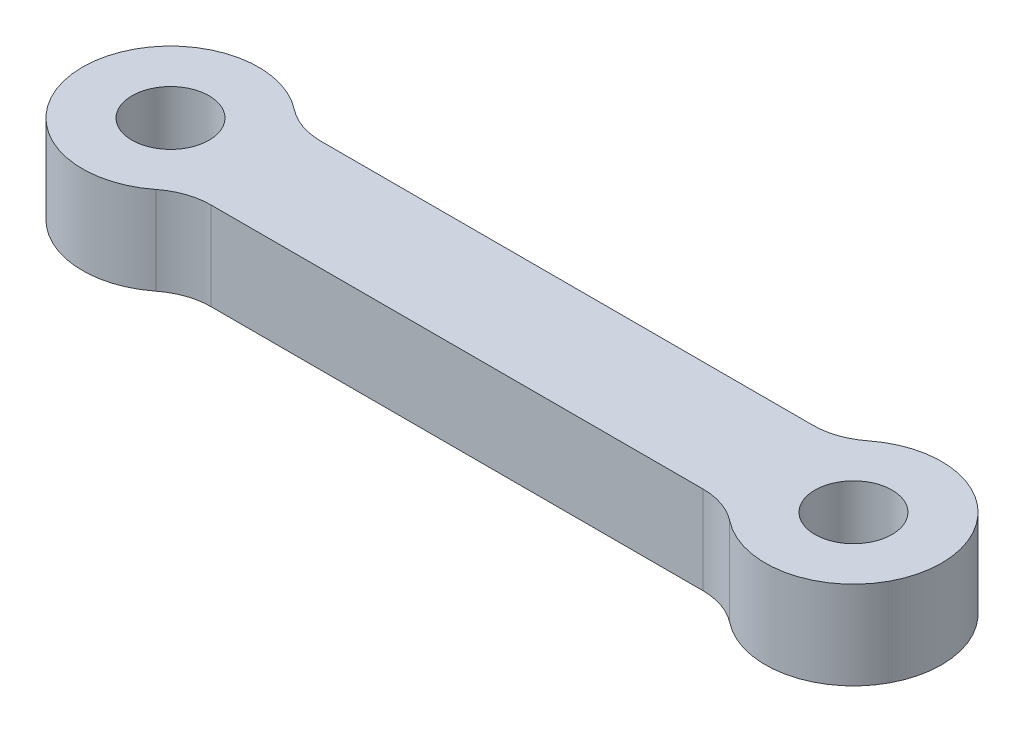
ISO-10303-21;
HEADER;
FILE_DESCRIPTION(('STEP AP214'),'2;1');
FILE_NAME('part.step','',(''),(''),'','','');
FILE_SCHEMA(('AUTOMOTIVE_DESIGN { 1 0 10303 214 1 1 1 1 }'));
ENDSEC;
DATA;
#1=APPLICATION_CONTEXT('core data for automotive mechanical design processes');
#2=APPLICATION_PROTOCOL_DEFINITION('international standard','automotive_design',2000,#1);
#3=PRODUCT_CONTEXT('',#1,'mechanical');
#4=PRODUCT('Part','Part','',(#3));
#5=PRODUCT_RELATED_PRODUCT_CATEGORY('part','',(#4));
#6=PRODUCT_DEFINITION_FORMATION('','',#4);
#7=PRODUCT_DEFINITION_CONTEXT('part definition',#1,'design');
#8=PRODUCT_DEFINITION('design','',#6,#7);
#9=PRODUCT_DEFINITION_SHAPE('','',#8);
#10=(LENGTH_UNIT() NAMED_UNIT(*) SI_UNIT(.MILLI.,.METRE.));
#11=(NAMED_UNIT(*) PLANE_ANGLE_UNIT() SI_UNIT($,.RADIAN.));
#12=(NAMED_UNIT(*) SI_UNIT($,.STERADIAN.) SOLID_ANGLE_UNIT());
#13=UNCERTAINTY_MEASURE_WITH_UNIT(LENGTH_MEASURE(1.E-05),#10,'distance_accuracy_value','');
#14=(GEOMETRIC_REPRESENTATION_CONTEXT(3) GLOBAL_UNCERTAINTY_ASSIGNED_CONTEXT((#13)) GLOBAL_UNIT_ASSIGNED_CONTEXT((#10,
#11,#12)) REPRESENTATION_CONTEXT('',''));
#15=CARTESIAN_POINT('',(0.,0.,0.));
#16=DIRECTION('',(0.,0.,1.));
#17=DIRECTION('',(1.,0.,0.));
#18=AXIS2_PLACEMENT_3D('',#15,#16,#17);
#19=CARTESIAN_POINT('',(31.,4.,0.));
#20=DIRECTION('',(0.,-1.,0.));
#21=DIRECTION('',(0.,0.,-1.));
#22=AXIS2_PLACEMENT_3D('',#19,#20,#21);
#23=CYLINDRICAL_SURFACE('',#22,4.00000000000001);
#24=CARTESIAN_POINT('',(31.,4.,0.));
#25=DIRECTION('',(0.,1.,0.));
#26=DIRECTION('',(0.,0.,1.));
#27=AXIS2_PLACEMENT_3D('',#24,#25,#26);
#28=CIRCLE('',#27,4.00000000000001);
#29=CARTESIAN_POINT('',(28.525641703473,4.,3.14285714285714));
#30=VERTEX_POINT('',#29);
#31=CARTESIAN_POINT('',(28.525641703473,4.,-3.14285714285714));
#32=VERTEX_POINT('',#31);
#33=EDGE_CURVE('E163',#30,#32,#28,.T.);
#34=ORIENTED_EDGE('',*,*,#33,.F.);
#35=DIRECTION('',(0.,-1.,0.));
#36=VECTOR('',#35,1.);
#37=CARTESIAN_POINT('',(28.525641703473,4.,3.14285714285714));
#38=LINE('',#37,#36);
#39=CARTESIAN_POINT('',(28.525641703473,0.,3.14285714285714));
#40=VERTEX_POINT('',#39);
#41=EDGE_CURVE('E175',#30,#40,#38,.T.);
#42=ORIENTED_EDGE('',*,*,#41,.T.);
#43=CARTESIAN_POINT('',(31.,0.,0.));
#44=DIRECTION('',(0.,1.,0.));
#45=DIRECTION('',(0.,0.,1.));
#46=AXIS2_PLACEMENT_3D('',#43,#44,#45);
#47=CIRCLE('',#46,4.00000000000001);
#48=CARTESIAN_POINT('',(28.525641703473,0.,-3.14285714285714));
#49=VERTEX_POINT('',#48);
#50=EDGE_CURVE('E203',#40,#49,#47,.T.);
#51=ORIENTED_EDGE('',*,*,#50,.T.);
#52=DIRECTION('',(0.,-1.,0.));
#53=VECTOR('',#52,1.);
#54=CARTESIAN_POINT('',(28.525641703473,4.,-3.14285714285714));
#55=LINE('',#54,#53);
#56=EDGE_CURVE('E172',#49,#32,#55,.F.);
#57=ORIENTED_EDGE('',*,*,#56,.T.);
#58=EDGE_LOOP('',(#34,#42,#51,#57));
#59=FACE_BOUND('',#58,.T.);
#60=ADVANCED_FACE('F49',(#59),#23,.T.);
#61=CARTESIAN_POINT('',(0.,4.,-2.5));
#62=DIRECTION('',(0.,0.,-1.));
#63=DIRECTION('',(-1.,0.,0.));
#64=AXIS2_PLACEMENT_3D('',#61,#62,#63);
#65=PLANE('',#64);
#66=DIRECTION('',(1.,0.,0.));
#67=VECTOR('',#66,1.);
#68=CARTESIAN_POINT('',(0.,4.,-2.5));
#69=LINE('',#68,#67);
#70=CARTESIAN_POINT('',(4.33012701892219,4.,-2.5));
#71=VERTEX_POINT('',#70);
#72=CARTESIAN_POINT('',(26.6698729810778,4.,-2.5));
#73=VERTEX_POINT('',#72);
#74=EDGE_CURVE('E210',#71,#73,#69,.T.);
#75=ORIENTED_EDGE('',*,*,#74,.T.);
#76=DIRECTION('',(0.,-1.,0.));
#77=VECTOR('',#76,1.);
#78=CARTESIAN_POINT('',(26.6698729810778,4.,-2.5));
#79=LINE('',#78,#77);
#80=CARTESIAN_POINT('',(26.6698729810778,0.,-2.5));
#81=VERTEX_POINT('',#80);
#82=EDGE_CURVE('E128',#73,#81,#79,.T.);
#83=ORIENTED_EDGE('',*,*,#82,.T.);
#84=DIRECTION('',(1.,0.,0.));
#85=VECTOR('',#84,1.);
#86=CARTESIAN_POINT('',(0.,0.,-2.5));
#87=LINE('',#86,#85);
#88=CARTESIAN_POINT('',(4.33012701892219,0.,-2.5));
#89=VERTEX_POINT('',#88);
#90=EDGE_CURVE('E156',#89,#81,#87,.T.);
#91=ORIENTED_EDGE('',*,*,#90,.F.);
#92=DIRECTION('',(0.,-1.,0.));
#93=VECTOR('',#92,1.);
#94=CARTESIAN_POINT('',(4.33012701892219,4.,-2.5));
#95=LINE('',#94,#93);
#96=EDGE_CURVE('E72',#89,#71,#95,.F.);
#97=ORIENTED_EDGE('',*,*,#96,.T.);
#98=EDGE_LOOP('',(#75,#83,#91,#97));
#99=FACE_BOUND('',#98,.T.);
#100=ADVANCED_FACE('F200',(#99),#65,.T.);
#101=CARTESIAN_POINT('',(0.,4.,0.));
#102=DIRECTION('',(0.,-1.,0.));
#103=DIRECTION('',(0.,0.,-1.));
#104=AXIS2_PLACEMENT_3D('',#101,#102,#103);
#105=CYLINDRICAL_SURFACE('',#104,4.);
#106=CARTESIAN_POINT('',(0.,0.,0.));
#107=DIRECTION('',(0.,1.,0.));
#108=DIRECTION('',(0.,0.,1.));
#109=AXIS2_PLACEMENT_3D('',#106,#107,#108);
#110=CIRCLE('',#109,4.);
#111=CARTESIAN_POINT('',(2.47435829652697,0.,-3.14285714285714));
#112=VERTEX_POINT('',#111);
#113=CARTESIAN_POINT('',(2.47435829652697,0.,3.14285714285714));
#114=VERTEX_POINT('',#113);
#115=EDGE_CURVE('E148',#112,#114,#110,.T.);
#116=ORIENTED_EDGE('',*,*,#115,.T.);
#117=DIRECTION('',(0.,-1.,0.));
#118=VECTOR('',#117,1.);
#119=CARTESIAN_POINT('',(2.47435829652697,4.,3.14285714285714));
#120=LINE('',#119,#118);
#121=CARTESIAN_POINT('',(2.47435829652697,4.,3.14285714285714));
#122=VERTEX_POINT('',#121);
#123=EDGE_CURVE('E121',#114,#122,#120,.F.);
#124=ORIENTED_EDGE('',*,*,#123,.T.);
#125=CARTESIAN_POINT('',(0.,4.,0.));
#126=DIRECTION('',(0.,1.,0.));
#127=DIRECTION('',(0.,0.,1.));
#128=AXIS2_PLACEMENT_3D('',#125,#126,#127);
#129=CIRCLE('',#128,4.);
#130=CARTESIAN_POINT('',(2.47435829652697,4.,-3.14285714285714));
#131=VERTEX_POINT('',#130);
#132=EDGE_CURVE('E209',#131,#122,#129,.T.);
#133=ORIENTED_EDGE('',*,*,#132,.F.);
#134=DIRECTION('',(0.,-1.,0.));
#135=VECTOR('',#134,1.);
#136=CARTESIAN_POINT('',(2.47435829652697,4.,-3.14285714285714));
#137=LINE('',#136,#135);
#138=EDGE_CURVE('E139',#131,#112,#137,.T.);
#139=ORIENTED_EDGE('',*,*,#138,.T.);
#140=EDGE_LOOP('',(#116,#124,#133,#139));
#141=FACE_BOUND('',#140,.T.);
#142=ADVANCED_FACE('F212',(#141),#105,.T.);
#143=CARTESIAN_POINT('',(0.,4.,0.));
#144=DIRECTION('',(0.,-1.,0.));
#145=DIRECTION('',(0.,0.,-1.));
#146=AXIS2_PLACEMENT_3D('',#143,#144,#145);
#147=CYLINDRICAL_SURFACE('',#146,1.75);
#148=CARTESIAN_POINT('',(0.,4.,0.));
#149=DIRECTION('',(0.,1.,0.));
#150=DIRECTION('',(0.,0.,1.));
#151=AXIS2_PLACEMENT_3D('',#148,#149,#150);
#152=CIRCLE('',#151,1.75);
#153=CARTESIAN_POINT('',(0.,4.,1.75));
#154=VERTEX_POINT('',#153);
#155=EDGE_CURVE('E218',#154,#154,#152,.T.);
#156=ORIENTED_EDGE('',*,*,#155,.T.);
#157=EDGE_LOOP('',(#156));
#158=FACE_BOUND('',#157,.T.);
#159=CARTESIAN_POINT('',(0.,0.,0.));
#160=DIRECTION('',(0.,1.,0.));
#161=DIRECTION('',(0.,0.,1.));
#162=AXIS2_PLACEMENT_3D('',#159,#160,#161);
#163=CIRCLE('',#162,1.75);
#164=CARTESIAN_POINT('',(0.,0.,1.75));
#165=VERTEX_POINT('',#164);
#166=EDGE_CURVE('E147',#165,#165,#163,.T.);
#167=ORIENTED_EDGE('',*,*,#166,.F.);
#168=EDGE_LOOP('',(#167));
#169=FACE_BOUND('',#168,.T.);
#170=ADVANCED_FACE('F268',(#158,#169),#147,.F.);
#171=CARTESIAN_POINT('',(0.,4.,2.5));
#172=DIRECTION('',(0.,0.,-1.));
#173=DIRECTION('',(-1.,0.,0.));
#174=AXIS2_PLACEMENT_3D('',#171,#172,#173);
#175=PLANE('',#174);
#176=DIRECTION('',(1.,0.,0.));
#177=VECTOR('',#176,1.);
#178=CARTESIAN_POINT('',(0.,4.,2.5));
#179=LINE('',#178,#177);
#180=CARTESIAN_POINT('',(4.3301270189222,4.,2.5));
#181=VERTEX_POINT('',#180);
#182=CARTESIAN_POINT('',(26.6698729810778,4.,2.5));
#183=VERTEX_POINT('',#182);
#184=EDGE_CURVE('E137',#181,#183,#179,.T.);
#185=ORIENTED_EDGE('',*,*,#184,.F.);
#186=DIRECTION('',(0.,1.,0.));
#187=VECTOR('',#186,1.);
#188=CARTESIAN_POINT('',(4.3301270189222,0.,2.5));
#189=LINE('',#188,#187);
#190=CARTESIAN_POINT('',(4.3301270189222,0.,2.5));
#191=VERTEX_POINT('',#190);
#192=EDGE_CURVE('E120',#181,#191,#189,.F.);
#193=ORIENTED_EDGE('',*,*,#192,.T.);
#194=DIRECTION('',(1.,0.,0.));
#195=VECTOR('',#194,1.);
#196=CARTESIAN_POINT('',(0.,0.,2.5));
#197=LINE('',#196,#195);
#198=CARTESIAN_POINT('',(26.6698729810778,0.,2.5));
#199=VERTEX_POINT('',#198);
#200=EDGE_CURVE('E134',#191,#199,#197,.T.);
#201=ORIENTED_EDGE('',*,*,#200,.T.);
#202=DIRECTION('',(0.,1.,0.));
#203=VECTOR('',#202,1.);
#204=CARTESIAN_POINT('',(26.6698729810778,4.,2.5));
#205=LINE('',#204,#203);
#206=EDGE_CURVE('E140',#199,#183,#205,.T.);
#207=ORIENTED_EDGE('',*,*,#206,.T.);
#208=EDGE_LOOP('',(#185,#193,#201,#207));
#209=FACE_BOUND('',#208,.T.);
#210=ADVANCED_FACE('F133',(#209),#175,.F.);
#211=CARTESIAN_POINT('',(31.,4.,0.));
#212=DIRECTION('',(0.,-1.,0.));
#213=DIRECTION('',(0.,0.,-1.));
#214=AXIS2_PLACEMENT_3D('',#211,#212,#213);
#215=CYLINDRICAL_SURFACE('',#214,1.75);
#216=CARTESIAN_POINT('',(31.,4.,0.));
#217=DIRECTION('',(0.,1.,0.));
#218=DIRECTION('',(0.,0.,1.));
#219=AXIS2_PLACEMENT_3D('',#216,#217,#218);
#220=CIRCLE('',#219,1.75);
#221=CARTESIAN_POINT('',(31.,4.,1.75));
#222=VERTEX_POINT('',#221);
#223=EDGE_CURVE('E165',#222,#222,#220,.T.);
#224=ORIENTED_EDGE('',*,*,#223,.T.);
#225=EDGE_LOOP('',(#224));
#226=FACE_BOUND('',#225,.T.);
#227=CARTESIAN_POINT('',(31.,0.,0.));
#228=DIRECTION('',(0.,1.,0.));
#229=DIRECTION('',(0.,0.,1.));
#230=AXIS2_PLACEMENT_3D('',#227,#228,#229);
#231=CIRCLE('',#230,1.75);
#232=CARTESIAN_POINT('',(31.,0.,1.75));
#233=VERTEX_POINT('',#232);
#234=EDGE_CURVE('E154',#233,#233,#231,.T.);
#235=ORIENTED_EDGE('',*,*,#234,.F.);
#236=EDGE_LOOP('',(#235));
#237=FACE_BOUND('',#236,.T.);
#238=ADVANCED_FACE('F262',(#226,#237),#215,.F.);
#239=CARTESIAN_POINT('',(0.,4.,0.));
#240=DIRECTION('',(0.,1.,0.));
#241=DIRECTION('',(0.,0.,1.));
#242=AXIS2_PLACEMENT_3D('',#239,#240,#241);
#243=PLANE('',#242);
#244=ORIENTED_EDGE('',*,*,#184,.T.);
#245=CARTESIAN_POINT('',(26.6698729810778,4.,5.5));
#246=DIRECTION('',(0.,1.,0.));
#247=DIRECTION('',(0.,0.,1.));
#248=AXIS2_PLACEMENT_3D('',#245,#246,#247);
#249=CIRCLE('',#248,3.);
#250=EDGE_CURVE('E188',#183,#30,#249,.F.);
#251=ORIENTED_EDGE('',*,*,#250,.T.);
#252=ORIENTED_EDGE('',*,*,#33,.T.);
#253=CARTESIAN_POINT('',(26.6698729810778,4.,-5.5));
#254=DIRECTION('',(0.,1.,0.));
#255=DIRECTION('',(0.,0.,1.));
#256=AXIS2_PLACEMENT_3D('',#253,#254,#255);
#257=CIRCLE('',#256,3.);
#258=EDGE_CURVE('E65',#32,#73,#257,.F.);
#259=ORIENTED_EDGE('',*,*,#258,.T.);
#260=ORIENTED_EDGE('',*,*,#74,.F.);
#261=CARTESIAN_POINT('',(4.33012701892219,4.,-5.5));
#262=DIRECTION('',(0.,1.,0.));
#263=DIRECTION('',(0.,0.,1.));
#264=AXIS2_PLACEMENT_3D('',#261,#262,#263);
#265=CIRCLE('',#264,3.);
#266=EDGE_CURVE('E11',#71,#131,#265,.F.);
#267=ORIENTED_EDGE('',*,*,#266,.T.);
#268=ORIENTED_EDGE('',*,*,#132,.T.);
#269=CARTESIAN_POINT('',(4.3301270189222,4.,5.5));
#270=DIRECTION('',(0.,1.,0.));
#271=DIRECTION('',(0.,0.,1.));
#272=AXIS2_PLACEMENT_3D('',#269,#270,#271);
#273=CIRCLE('',#272,3.);
#274=EDGE_CURVE('E127',#122,#181,#273,.F.);
#275=ORIENTED_EDGE('',*,*,#274,.T.);
#276=EDGE_LOOP('',(#244,#251,#252,#259,#260,#267,#268,#275));
#277=FACE_BOUND('',#276,.T.);
#278=ORIENTED_EDGE('',*,*,#155,.F.);
#279=EDGE_LOOP('',(#278));
#280=FACE_BOUND('',#279,.T.);
#281=ORIENTED_EDGE('',*,*,#223,.F.);
#282=EDGE_LOOP('',(#281));
#283=FACE_BOUND('',#282,.T.);
#284=ADVANCED_FACE('F207',(#277,#280,#283),#243,.T.);
#285=CARTESIAN_POINT('',(0.,0.,0.));
#286=DIRECTION('',(0.,1.,0.));
#287=DIRECTION('',(0.,0.,1.));
#288=AXIS2_PLACEMENT_3D('',#285,#286,#287);
#289=PLANE('',#288);
#290=ORIENTED_EDGE('',*,*,#50,.F.);
#291=CARTESIAN_POINT('',(26.6698729810778,0.,5.5));
#292=DIRECTION('',(0.,1.,0.));
#293=DIRECTION('',(0.,0.,1.));
#294=AXIS2_PLACEMENT_3D('',#291,#292,#293);
#295=CIRCLE('',#294,3.);
#296=EDGE_CURVE('E145',#40,#199,#295,.T.);
#297=ORIENTED_EDGE('',*,*,#296,.T.);
#298=ORIENTED_EDGE('',*,*,#200,.F.);
#299=CARTESIAN_POINT('',(4.3301270189222,0.,5.5));
#300=DIRECTION('',(0.,1.,0.));
#301=DIRECTION('',(0.,0.,1.));
#302=AXIS2_PLACEMENT_3D('',#299,#300,#301);
#303=CIRCLE('',#302,3.);
#304=EDGE_CURVE('E116',#191,#114,#303,.T.);
#305=ORIENTED_EDGE('',*,*,#304,.T.);
#306=ORIENTED_EDGE('',*,*,#115,.F.);
#307=CARTESIAN_POINT('',(4.33012701892219,0.,-5.5));
#308=DIRECTION('',(0.,1.,0.));
#309=DIRECTION('',(0.,0.,1.));
#310=AXIS2_PLACEMENT_3D('',#307,#308,#309);
#311=CIRCLE('',#310,3.);
#312=EDGE_CURVE('E58',#112,#89,#311,.T.);
#313=ORIENTED_EDGE('',*,*,#312,.T.);
#314=ORIENTED_EDGE('',*,*,#90,.T.);
#315=CARTESIAN_POINT('',(26.6698729810778,0.,-5.5));
#316=DIRECTION('',(0.,1.,0.));
#317=DIRECTION('',(0.,0.,1.));
#318=AXIS2_PLACEMENT_3D('',#315,#316,#317);
#319=CIRCLE('',#318,3.);
#320=EDGE_CURVE('E191',#81,#49,#319,.T.);
#321=ORIENTED_EDGE('',*,*,#320,.T.);
#322=EDGE_LOOP('',(#290,#297,#298,#305,#306,#313,#314,#321));
#323=FACE_BOUND('',#322,.T.);
#324=ORIENTED_EDGE('',*,*,#166,.T.);
#325=EDGE_LOOP('',(#324));
#326=FACE_BOUND('',#325,.T.);
#327=ORIENTED_EDGE('',*,*,#234,.T.);
#328=EDGE_LOOP('',(#327));
#329=FACE_BOUND('',#328,.T.);
#330=ADVANCED_FACE('F143',(#323,#326,#329),#289,.F.);
#331=CARTESIAN_POINT('',(4.3301270189222,4.,5.5));
#332=DIRECTION('',(0.,-1.,0.));
#333=DIRECTION('',(0.,0.,-1.));
#334=AXIS2_PLACEMENT_3D('',#331,#332,#333);
#335=CYLINDRICAL_SURFACE('',#334,3.);
#336=ORIENTED_EDGE('',*,*,#274,.F.);
#337=ORIENTED_EDGE('',*,*,#123,.F.);
#338=ORIENTED_EDGE('',*,*,#304,.F.);
#339=ORIENTED_EDGE('',*,*,#192,.F.);
#340=EDGE_LOOP('',(#336,#337,#338,#339));
#341=FACE_BOUND('',#340,.T.);
#342=ADVANCED_FACE('F119',(#341),#335,.F.);
#343=CARTESIAN_POINT('',(26.6698729810778,4.,5.5));
#344=DIRECTION('',(0.,-1.,0.));
#345=DIRECTION('',(0.,0.,-1.));
#346=AXIS2_PLACEMENT_3D('',#343,#344,#345);
#347=CYLINDRICAL_SURFACE('',#346,3.);
#348=ORIENTED_EDGE('',*,*,#250,.F.);
#349=ORIENTED_EDGE('',*,*,#206,.F.);
#350=ORIENTED_EDGE('',*,*,#296,.F.);
#351=ORIENTED_EDGE('',*,*,#41,.F.);
#352=EDGE_LOOP('',(#348,#349,#350,#351));
#353=FACE_BOUND('',#352,.T.);
#354=ADVANCED_FACE('F239',(#353),#347,.F.);
#355=CARTESIAN_POINT('',(26.6698729810778,4.,-5.5));
#356=DIRECTION('',(0.,-1.,0.));
#357=DIRECTION('',(0.,0.,-1.));
#358=AXIS2_PLACEMENT_3D('',#355,#356,#357);
#359=CYLINDRICAL_SURFACE('',#358,3.);
#360=ORIENTED_EDGE('',*,*,#258,.F.);
#361=ORIENTED_EDGE('',*,*,#56,.F.);
#362=ORIENTED_EDGE('',*,*,#320,.F.);
#363=ORIENTED_EDGE('',*,*,#82,.F.);
#364=EDGE_LOOP('',(#360,#361,#362,#363));
#365=FACE_BOUND('',#364,.T.);
#366=ADVANCED_FACE('F237',(#365),#359,.F.);
#367=CARTESIAN_POINT('',(4.33012701892219,4.,-5.5));
#368=DIRECTION('',(0.,-1.,0.));
#369=DIRECTION('',(0.,0.,-1.));
#370=AXIS2_PLACEMENT_3D('',#367,#368,#369);
#371=CYLINDRICAL_SURFACE('',#370,3.);
#372=ORIENTED_EDGE('',*,*,#266,.F.);
#373=ORIENTED_EDGE('',*,*,#96,.F.);
#374=ORIENTED_EDGE('',*,*,#312,.F.);
#375=ORIENTED_EDGE('',*,*,#138,.F.);
#376=EDGE_LOOP('',(#372,#373,#374,#375));
#377=FACE_BOUND('',#376,.T.);
#378=ADVANCED_FACE('F51',(#377),#371,.F.);
#379=CLOSED_SHELL('',(#60,#100,#142,#170,#210,#238,#284,#330,#342,#354,#366,#378));
#380=MANIFOLD_SOLID_BREP('B2',#379);
#381=ADVANCED_BREP_SHAPE_REPRESENTATION('',(#18,#380),#14);
#382=SHAPE_DEFINITION_REPRESENTATION(#9,#381);
ENDSEC;
END-ISO-10303-21;
